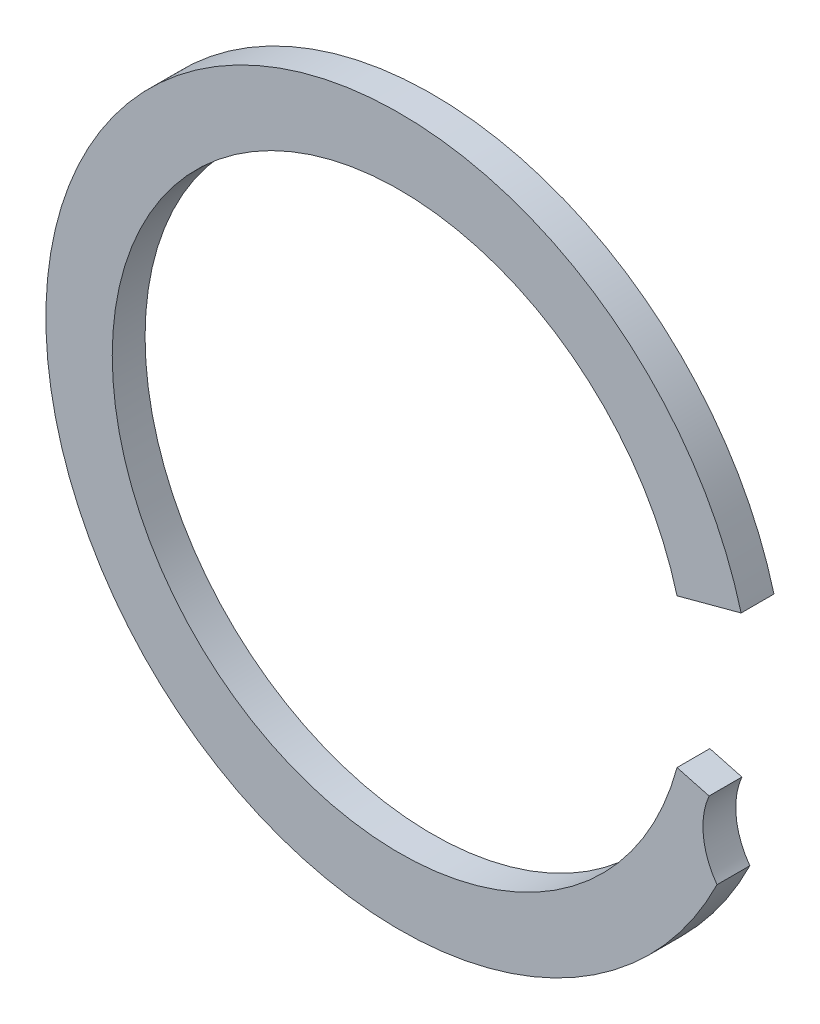
ISO-10303-21;
HEADER;
FILE_DESCRIPTION(('STEP AP214'),'2;1');
FILE_NAME('part.step','',(''),(''),'','','');
FILE_SCHEMA(('AUTOMOTIVE_DESIGN { 1 0 10303 214 1 1 1 1 }'));
ENDSEC;
DATA;
#1=APPLICATION_CONTEXT('core data for automotive mechanical design processes');
#2=APPLICATION_PROTOCOL_DEFINITION('international standard','automotive_design',2000,#1);
#3=PRODUCT_CONTEXT('',#1,'mechanical');
#4=PRODUCT('Part','Part','',(#3));
#5=PRODUCT_RELATED_PRODUCT_CATEGORY('part','',(#4));
#6=PRODUCT_DEFINITION_FORMATION('','',#4);
#7=PRODUCT_DEFINITION_CONTEXT('part definition',#1,'design');
#8=PRODUCT_DEFINITION('design','',#6,#7);
#9=PRODUCT_DEFINITION_SHAPE('','',#8);
#10=(LENGTH_UNIT() NAMED_UNIT(*) SI_UNIT(.MILLI.,.METRE.));
#11=(NAMED_UNIT(*) PLANE_ANGLE_UNIT() SI_UNIT($,.RADIAN.));
#12=(NAMED_UNIT(*) SI_UNIT($,.STERADIAN.) SOLID_ANGLE_UNIT());
#13=UNCERTAINTY_MEASURE_WITH_UNIT(LENGTH_MEASURE(1.E-05),#10,'distance_accuracy_value','');
#14=(GEOMETRIC_REPRESENTATION_CONTEXT(3) GLOBAL_UNCERTAINTY_ASSIGNED_CONTEXT((#13)) GLOBAL_UNIT_ASSIGNED_CONTEXT((#10,
#11,#12)) REPRESENTATION_CONTEXT('',''));
#15=CARTESIAN_POINT('',(0.,0.,0.));
#16=DIRECTION('',(0.,0.,1.));
#17=DIRECTION('',(1.,0.,0.));
#18=AXIS2_PLACEMENT_3D('',#15,#16,#17);
#19=CARTESIAN_POINT('',(10.7989612060013,-3.2200101266949,0.94));
#20=DIRECTION('',(0.,0.,-1.));
#21=DIRECTION('',(-1.,0.,0.));
#22=AXIS2_PLACEMENT_3D('',#19,#20,#21);
#23=CYLINDRICAL_SURFACE('',#22,2.11305381620982);
#24=CARTESIAN_POINT('',(10.7989612060013,-3.2200101266949,0.));
#25=DIRECTION('',(0.,0.,-1.));
#26=DIRECTION('',(1.,0.,0.));
#27=AXIS2_PLACEMENT_3D('',#24,#25,#26);
#28=CIRCLE('',#27,2.11305381620982);
#29=CARTESIAN_POINT('',(9.08905529948256,-4.46146822951234,0.));
#30=VERTEX_POINT('',#29);
#31=CARTESIAN_POINT('',(8.86236945620222,-2.37466473881557,0.));
#32=VERTEX_POINT('',#31);
#33=EDGE_CURVE('E106',#30,#32,#28,.T.);
#34=ORIENTED_EDGE('',*,*,#33,.T.);
#35=DIRECTION('',(0.,0.,-1.));
#36=VECTOR('',#35,1.);
#37=CARTESIAN_POINT('',(8.86236945620222,-2.37466473881557,0.94));
#38=LINE('',#37,#36);
#39=CARTESIAN_POINT('',(8.86236945620222,-2.37466473881557,0.94));
#40=VERTEX_POINT('',#39);
#41=EDGE_CURVE('E11',#40,#32,#38,.T.);
#42=ORIENTED_EDGE('',*,*,#41,.F.);
#43=CARTESIAN_POINT('',(10.7989612060013,-3.2200101266949,0.94));
#44=DIRECTION('',(0.,0.,-1.));
#45=DIRECTION('',(1.,0.,0.));
#46=AXIS2_PLACEMENT_3D('',#43,#44,#45);
#47=CIRCLE('',#46,2.11305381620982);
#48=CARTESIAN_POINT('',(9.08905529948256,-4.46146822951234,0.94));
#49=VERTEX_POINT('',#48);
#50=EDGE_CURVE('E114',#49,#40,#47,.T.);
#51=ORIENTED_EDGE('',*,*,#50,.F.);
#52=DIRECTION('',(0.,0.,-1.));
#53=VECTOR('',#52,1.);
#54=CARTESIAN_POINT('',(9.08905529948256,-4.46146822951234,0.94));
#55=LINE('',#54,#53);
#56=EDGE_CURVE('E102',#49,#30,#55,.T.);
#57=ORIENTED_EDGE('',*,*,#56,.T.);
#58=EDGE_LOOP('',(#34,#42,#51,#57));
#59=FACE_BOUND('',#58,.T.);
#60=ADVANCED_FACE('F32',(#59),#23,.F.);
#61=CARTESIAN_POINT('',(7.9447399212276,-2.12878664596818,0.94));
#62=DIRECTION('',(-0.258819045102515,-0.96592582628907,0.));
#63=DIRECTION('',(0.96592582628907,-0.258819045102515,0.));
#64=AXIS2_PLACEMENT_3D('',#61,#62,#63);
#65=PLANE('',#64);
#66=DIRECTION('',(-0.96592582628907,0.258819045102515,0.));
#67=VECTOR('',#66,1.);
#68=CARTESIAN_POINT('',(7.9447399212276,-2.12878664596818,0.));
#69=LINE('',#68,#67);
#70=CARTESIAN_POINT('',(7.9447399212276,-2.12878664596818,0.));
#71=VERTEX_POINT('',#70);
#72=EDGE_CURVE('E109',#32,#71,#69,.T.);
#73=ORIENTED_EDGE('',*,*,#72,.T.);
#74=DIRECTION('',(0.,0.,-1.));
#75=VECTOR('',#74,1.);
#76=CARTESIAN_POINT('',(7.9447399212276,-2.12878664596818,0.94));
#77=LINE('',#76,#75);
#78=CARTESIAN_POINT('',(7.9447399212276,-2.12878664596818,0.94));
#79=VERTEX_POINT('',#78);
#80=EDGE_CURVE('E40',#79,#71,#77,.T.);
#81=ORIENTED_EDGE('',*,*,#80,.F.);
#82=DIRECTION('',(-0.96592582628907,0.258819045102515,0.));
#83=VECTOR('',#82,1.);
#84=CARTESIAN_POINT('',(7.9447399212276,-2.12878664596818,0.94));
#85=LINE('',#84,#83);
#86=EDGE_CURVE('E81',#40,#79,#85,.T.);
#87=ORIENTED_EDGE('',*,*,#86,.F.);
#88=ORIENTED_EDGE('',*,*,#41,.T.);
#89=EDGE_LOOP('',(#73,#81,#87,#88));
#90=FACE_BOUND('',#89,.T.);
#91=ADVANCED_FACE('F133',(#90),#65,.F.);
#92=CARTESIAN_POINT('',(0.,0.,0.94));
#93=DIRECTION('',(0.,0.,-1.));
#94=DIRECTION('',(-1.,0.,0.));
#95=AXIS2_PLACEMENT_3D('',#92,#93,#94);
#96=CYLINDRICAL_SURFACE('',#95,8.225);
#97=CARTESIAN_POINT('',(0.,0.,0.));
#98=DIRECTION('',(0.,0.,-1.));
#99=DIRECTION('',(1.,0.,0.));
#100=AXIS2_PLACEMENT_3D('',#97,#98,#99);
#101=CIRCLE('',#100,8.225);
#102=CARTESIAN_POINT('',(7.9447399212276,2.12878664596818,0.));
#103=VERTEX_POINT('',#102);
#104=EDGE_CURVE('E97',#71,#103,#101,.T.);
#105=ORIENTED_EDGE('',*,*,#104,.T.);
#106=DIRECTION('',(0.,0.,-1.));
#107=VECTOR('',#106,1.);
#108=CARTESIAN_POINT('',(7.9447399212276,2.12878664596818,0.94));
#109=LINE('',#108,#107);
#110=CARTESIAN_POINT('',(7.9447399212276,2.12878664596818,0.94));
#111=VERTEX_POINT('',#110);
#112=EDGE_CURVE('E94',#111,#103,#109,.T.);
#113=ORIENTED_EDGE('',*,*,#112,.F.);
#114=CARTESIAN_POINT('',(0.,0.,0.94));
#115=DIRECTION('',(0.,0.,-1.));
#116=DIRECTION('',(1.,0.,0.));
#117=AXIS2_PLACEMENT_3D('',#114,#115,#116);
#118=CIRCLE('',#117,8.225);
#119=EDGE_CURVE('E85',#79,#111,#118,.T.);
#120=ORIENTED_EDGE('',*,*,#119,.F.);
#121=ORIENTED_EDGE('',*,*,#80,.T.);
#122=EDGE_LOOP('',(#105,#113,#120,#121));
#123=FACE_BOUND('',#122,.T.);
#124=ADVANCED_FACE('F95',(#123),#96,.F.);
#125=CARTESIAN_POINT('',(8.86236945620221,2.37466473881557,0.94));
#126=DIRECTION('',(-0.25881904510251,0.965925826289071,0.));
#127=DIRECTION('',(-0.965925826289071,-0.25881904510251,0.));
#128=AXIS2_PLACEMENT_3D('',#125,#126,#127);
#129=PLANE('',#128);
#130=DIRECTION('',(0.965925826289071,0.25881904510251,0.));
#131=VECTOR('',#130,1.);
#132=CARTESIAN_POINT('',(8.86236945620221,2.37466473881557,0.));
#133=LINE('',#132,#131);
#134=CARTESIAN_POINT('',(9.77999899117683,2.62054283166296,0.));
#135=VERTEX_POINT('',#134);
#136=EDGE_CURVE('E67',#103,#135,#133,.T.);
#137=ORIENTED_EDGE('',*,*,#136,.T.);
#138=DIRECTION('',(0.,0.,-1.));
#139=VECTOR('',#138,1.);
#140=CARTESIAN_POINT('',(9.77999899117683,2.62054283166296,0.94));
#141=LINE('',#140,#139);
#142=CARTESIAN_POINT('',(9.77999899117683,2.62054283166296,0.94));
#143=VERTEX_POINT('',#142);
#144=EDGE_CURVE('E98',#143,#135,#141,.T.);
#145=ORIENTED_EDGE('',*,*,#144,.F.);
#146=DIRECTION('',(0.965925826289069,0.258819045102519,0.));
#147=VECTOR('',#146,1.);
#148=CARTESIAN_POINT('',(7.9447399212276,2.12878664596818,0.94));
#149=LINE('',#148,#147);
#150=EDGE_CURVE('E89',#111,#143,#149,.T.);
#151=ORIENTED_EDGE('',*,*,#150,.F.);
#152=ORIENTED_EDGE('',*,*,#112,.T.);
#153=EDGE_LOOP('',(#137,#145,#151,#152));
#154=FACE_BOUND('',#153,.T.);
#155=ADVANCED_FACE('F100',(#154),#129,.F.);
#156=CARTESIAN_POINT('',(0.,0.,0.94));
#157=DIRECTION('',(0.,0.,-1.));
#158=DIRECTION('',(-1.,0.,0.));
#159=AXIS2_PLACEMENT_3D('',#156,#157,#158);
#160=CYLINDRICAL_SURFACE('',#159,10.125);
#161=CARTESIAN_POINT('',(0.,0.,0.));
#162=DIRECTION('',(0.,0.,1.));
#163=DIRECTION('',(1.,0.,0.));
#164=AXIS2_PLACEMENT_3D('',#161,#162,#163);
#165=CIRCLE('',#164,10.125);
#166=EDGE_CURVE('E73',#135,#30,#165,.T.);
#167=ORIENTED_EDGE('',*,*,#166,.T.);
#168=ORIENTED_EDGE('',*,*,#56,.F.);
#169=CARTESIAN_POINT('',(0.,0.,0.94));
#170=DIRECTION('',(0.,0.,1.));
#171=DIRECTION('',(1.,0.,0.));
#172=AXIS2_PLACEMENT_3D('',#169,#170,#171);
#173=CIRCLE('',#172,10.125);
#174=EDGE_CURVE('E48',#143,#49,#173,.T.);
#175=ORIENTED_EDGE('',*,*,#174,.F.);
#176=ORIENTED_EDGE('',*,*,#144,.T.);
#177=EDGE_LOOP('',(#167,#168,#175,#176));
#178=FACE_BOUND('',#177,.T.);
#179=ADVANCED_FACE('F122',(#178),#160,.T.);
#180=CARTESIAN_POINT('',(10.7989612060013,-3.2200101266949,0.94));
#181=DIRECTION('',(0.,0.,1.));
#182=DIRECTION('',(1.,0.,0.));
#183=AXIS2_PLACEMENT_3D('',#180,#181,#182);
#184=PLANE('',#183);
#185=ORIENTED_EDGE('',*,*,#50,.T.);
#186=ORIENTED_EDGE('',*,*,#86,.T.);
#187=ORIENTED_EDGE('',*,*,#119,.T.);
#188=ORIENTED_EDGE('',*,*,#150,.T.);
#189=ORIENTED_EDGE('',*,*,#174,.T.);
#190=EDGE_LOOP('',(#185,#186,#187,#188,#189));
#191=FACE_BOUND('',#190,.T.);
#192=ADVANCED_FACE('F87',(#191),#184,.T.);
#193=CARTESIAN_POINT('',(10.7989612060013,-3.2200101266949,0.));
#194=DIRECTION('',(0.,0.,1.));
#195=DIRECTION('',(1.,0.,0.));
#196=AXIS2_PLACEMENT_3D('',#193,#194,#195);
#197=PLANE('',#196);
#198=ORIENTED_EDGE('',*,*,#33,.F.);
#199=ORIENTED_EDGE('',*,*,#166,.F.);
#200=ORIENTED_EDGE('',*,*,#136,.F.);
#201=ORIENTED_EDGE('',*,*,#104,.F.);
#202=ORIENTED_EDGE('',*,*,#72,.F.);
#203=EDGE_LOOP('',(#198,#199,#200,#201,#202));
#204=FACE_BOUND('',#203,.T.);
#205=ADVANCED_FACE('F118',(#204),#197,.F.);
#206=CLOSED_SHELL('',(#60,#91,#124,#155,#179,#192,#205));
#207=MANIFOLD_SOLID_BREP('B2',#206);
#208=ADVANCED_BREP_SHAPE_REPRESENTATION('',(#18,#207),#14);
#209=SHAPE_DEFINITION_REPRESENTATION(#9,#208);
ENDSEC;
END-ISO-10303-21;
